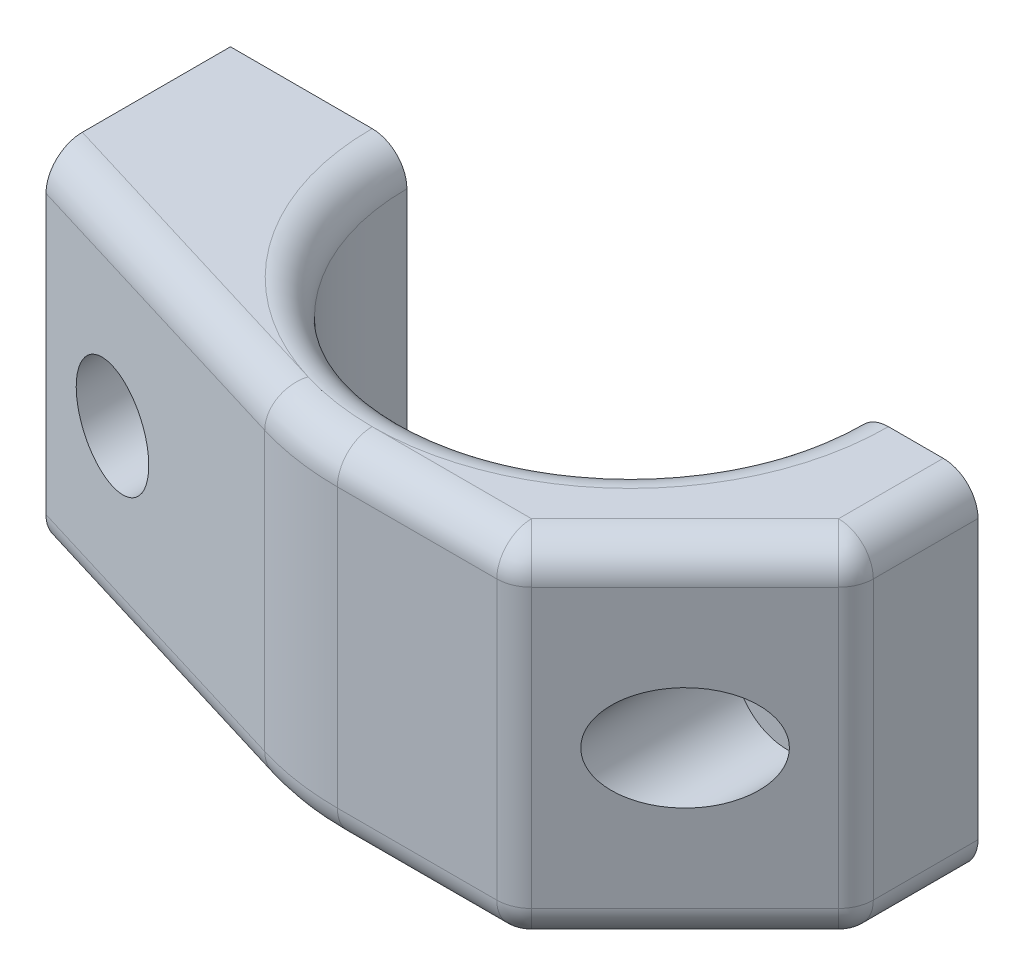
ISO-10303-21;
HEADER;
FILE_DESCRIPTION(('STEP AP214'),'2;1');
FILE_NAME('part.step','',(''),(''),'','','');
FILE_SCHEMA(('AUTOMOTIVE_DESIGN { 1 0 10303 214 1 1 1 1 }'));
ENDSEC;
DATA;
#1=APPLICATION_CONTEXT('core data for automotive mechanical design processes');
#2=APPLICATION_PROTOCOL_DEFINITION('international standard','automotive_design',2000,#1);
#3=PRODUCT_CONTEXT('',#1,'mechanical');
#4=PRODUCT('Part','Part','',(#3));
#5=PRODUCT_RELATED_PRODUCT_CATEGORY('part','',(#4));
#6=PRODUCT_DEFINITION_FORMATION('','',#4);
#7=PRODUCT_DEFINITION_CONTEXT('part definition',#1,'design');
#8=PRODUCT_DEFINITION('design','',#6,#7);
#9=PRODUCT_DEFINITION_SHAPE('','',#8);
#10=(LENGTH_UNIT() NAMED_UNIT(*) SI_UNIT(.MILLI.,.METRE.));
#11=(NAMED_UNIT(*) PLANE_ANGLE_UNIT() SI_UNIT($,.RADIAN.));
#12=(NAMED_UNIT(*) SI_UNIT($,.STERADIAN.) SOLID_ANGLE_UNIT());
#13=UNCERTAINTY_MEASURE_WITH_UNIT(LENGTH_MEASURE(1.E-05),#10,'distance_accuracy_value','');
#14=(GEOMETRIC_REPRESENTATION_CONTEXT(3) GLOBAL_UNCERTAINTY_ASSIGNED_CONTEXT((#13)) GLOBAL_UNIT_ASSIGNED_CONTEXT((#10,
#11,#12)) REPRESENTATION_CONTEXT('',''));
#15=CARTESIAN_POINT('',(0.,0.,0.));
#16=DIRECTION('',(0.,0.,1.));
#17=DIRECTION('',(1.,0.,0.));
#18=AXIS2_PLACEMENT_3D('',#15,#16,#17);
#19=CARTESIAN_POINT('',(54.15,0.,-16.85));
#20=DIRECTION('',(0.,0.,1.));
#21=DIRECTION('',(1.,0.,0.));
#22=AXIS2_PLACEMENT_3D('',#19,#20,#21);
#23=CYLINDRICAL_SURFACE('',#22,1.65);
#24=CARTESIAN_POINT('',(54.15,0.,6.));
#25=DIRECTION('',(0.,0.,1.));
#26=DIRECTION('',(1.,0.,0.));
#27=AXIS2_PLACEMENT_3D('',#24,#25,#26);
#28=CIRCLE('',#27,1.65);
#29=CARTESIAN_POINT('',(55.8,0.,6.));
#30=VERTEX_POINT('',#29);
#31=EDGE_CURVE('E342',#30,#30,#28,.F.);
#32=ORIENTED_EDGE('',*,*,#31,.F.);
#33=EDGE_LOOP('',(#32));
#34=FACE_BOUND('',#33,.T.);
#35=CARTESIAN_POINT('',(54.15,0.,0.));
#36=DIRECTION('',(0.,0.,-1.));
#37=DIRECTION('',(-1.,0.,0.));
#38=AXIS2_PLACEMENT_3D('',#35,#36,#37);
#39=CIRCLE('',#38,1.65);
#40=CARTESIAN_POINT('',(52.5,0.,0.));
#41=VERTEX_POINT('',#40);
#42=EDGE_CURVE('E415',#41,#41,#39,.F.);
#43=ORIENTED_EDGE('',*,*,#42,.F.);
#44=EDGE_LOOP('',(#43));
#45=FACE_BOUND('',#44,.T.);
#46=ADVANCED_FACE('F60',(#34,#45),#23,.F.);
#47=CARTESIAN_POINT('',(21.65,0.,-16.85));
#48=DIRECTION('',(0.,0.,1.));
#49=DIRECTION('',(1.,0.,0.));
#50=AXIS2_PLACEMENT_3D('',#47,#48,#49);
#51=CYLINDRICAL_SURFACE('',#50,1.65);
#52=CARTESIAN_POINT('',(21.65,0.,6.));
#53=DIRECTION('',(0.,0.,1.));
#54=DIRECTION('',(1.,0.,0.));
#55=AXIS2_PLACEMENT_3D('',#52,#53,#54);
#56=CIRCLE('',#55,1.65);
#57=CARTESIAN_POINT('',(23.3,0.,6.));
#58=VERTEX_POINT('',#57);
#59=EDGE_CURVE('E339',#58,#58,#56,.F.);
#60=ORIENTED_EDGE('',*,*,#59,.F.);
#61=EDGE_LOOP('',(#60));
#62=FACE_BOUND('',#61,.T.);
#63=CARTESIAN_POINT('',(21.65,0.,0.));
#64=DIRECTION('',(0.,0.,-1.));
#65=DIRECTION('',(-1.,0.,0.));
#66=AXIS2_PLACEMENT_3D('',#63,#64,#65);
#67=CIRCLE('',#66,1.65);
#68=CARTESIAN_POINT('',(20.,0.,0.));
#69=VERTEX_POINT('',#68);
#70=EDGE_CURVE('E200',#69,#69,#67,.F.);
#71=ORIENTED_EDGE('',*,*,#70,.F.);
#72=EDGE_LOOP('',(#71));
#73=FACE_BOUND('',#72,.T.);
#74=ADVANCED_FACE('F473',(#62,#73),#51,.F.);
#75=CARTESIAN_POINT('',(39.15,10.,0.));
#76=DIRECTION('',(0.,1.,0.));
#77=DIRECTION('',(0.,0.,1.));
#78=AXIS2_PLACEMENT_3D('',#75,#76,#77);
#79=PLANE('',#78);
#80=CARTESIAN_POINT('',(39.15,10.,0.));
#81=DIRECTION('',(0.,1.,0.));
#82=DIRECTION('',(0.,0.,1.));
#83=AXIS2_PLACEMENT_3D('',#80,#81,#82);
#84=CIRCLE('',#83,14.85);
#85=CARTESIAN_POINT('',(34.8233951804406,10.,14.2057379511015));
#86=VERTEX_POINT('',#85);
#87=CARTESIAN_POINT('',(24.3,10.,0.));
#88=VERTEX_POINT('',#87);
#89=EDGE_CURVE('E251',#86,#88,#84,.F.);
#90=ORIENTED_EDGE('',*,*,#89,.T.);
#91=DIRECTION('',(-1.,0.,0.));
#92=VECTOR('',#91,1.);
#93=CARTESIAN_POINT('',(39.15,10.,0.));
#94=LINE('',#93,#92);
#95=CARTESIAN_POINT('',(16.15,10.,0.));
#96=VERTEX_POINT('',#95);
#97=EDGE_CURVE('E75',#88,#96,#94,.T.);
#98=ORIENTED_EDGE('',*,*,#97,.T.);
#99=DIRECTION('',(0.,0.,1.));
#100=VECTOR('',#99,1.);
#101=CARTESIAN_POINT('',(16.15,10.,0.));
#102=LINE('',#101,#100);
#103=CARTESIAN_POINT('',(16.15,10.,8.51843033897093));
#104=VERTEX_POINT('',#103);
#105=EDGE_CURVE('E207',#104,#96,#102,.F.);
#106=ORIENTED_EDGE('',*,*,#105,.F.);
#107=DIRECTION('',(0.956615350242525,0.,0.29135385990299));
#108=VECTOR('',#107,1.);
#109=CARTESIAN_POINT('',(34.8233951804406,10.,14.2057379511015));
#110=LINE('',#109,#108);
#111=EDGE_CURVE('E254',#104,#86,#110,.T.);
#112=ORIENTED_EDGE('',*,*,#111,.T.);
#113=EDGE_LOOP('',(#90,#98,#106,#112));
#114=FACE_BOUND('',#113,.T.);
#115=ADVANCED_FACE('F357',(#114),#79,.T.);
#116=CARTESIAN_POINT('',(39.15,-10.,0.));
#117=DIRECTION('',(0.,1.,0.));
#118=DIRECTION('',(0.,0.,1.));
#119=AXIS2_PLACEMENT_3D('',#116,#117,#118);
#120=PLANE('',#119);
#121=DIRECTION('',(-1.,0.,0.));
#122=VECTOR('',#121,1.);
#123=CARTESIAN_POINT('',(39.15,-10.,0.));
#124=LINE('',#123,#122);
#125=CARTESIAN_POINT('',(57.15,-10.,0.));
#126=VERTEX_POINT('',#125);
#127=CARTESIAN_POINT('',(54.,-10.,0.));
#128=VERTEX_POINT('',#127);
#129=EDGE_CURVE('E404',#126,#128,#124,.T.);
#130=ORIENTED_EDGE('',*,*,#129,.F.);
#131=DIRECTION('',(0.,0.,-1.));
#132=VECTOR('',#131,1.);
#133=CARTESIAN_POINT('',(57.15,-10.,0.));
#134=LINE('',#133,#132);
#135=CARTESIAN_POINT('',(57.15,-10.,6.02157287525381));
#136=VERTEX_POINT('',#135);
#137=EDGE_CURVE('E230',#126,#136,#134,.F.);
#138=ORIENTED_EDGE('',*,*,#137,.T.);
#139=DIRECTION('',(-0.707106781186548,0.,0.707106781186548));
#140=VECTOR('',#139,1.);
#141=CARTESIAN_POINT('',(51.1607864376269,-10.,12.0107864376269));
#142=LINE('',#141,#140);
#143=CARTESIAN_POINT('',(48.3215728752538,-10.,14.85));
#144=VERTEX_POINT('',#143);
#145=EDGE_CURVE('E228',#136,#144,#142,.T.);
#146=ORIENTED_EDGE('',*,*,#145,.T.);
#147=DIRECTION('',(1.,0.,0.));
#148=VECTOR('',#147,1.);
#149=CARTESIAN_POINT('',(39.15,-10.,14.85));
#150=LINE('',#149,#148);
#151=CARTESIAN_POINT('',(39.15,-10.,14.85));
#152=VERTEX_POINT('',#151);
#153=EDGE_CURVE('E226',#144,#152,#150,.F.);
#154=ORIENTED_EDGE('',*,*,#153,.T.);
#155=CARTESIAN_POINT('',(39.15,-10.,0.));
#156=DIRECTION('',(0.,1.,0.));
#157=DIRECTION('',(0.,0.,1.));
#158=AXIS2_PLACEMENT_3D('',#155,#156,#157);
#159=CIRCLE('',#158,14.85);
#160=EDGE_CURVE('E223',#152,#128,#159,.T.);
#161=ORIENTED_EDGE('',*,*,#160,.T.);
#162=EDGE_LOOP('',(#130,#138,#146,#154,#161));
#163=FACE_BOUND('',#162,.T.);
#164=ADVANCED_FACE('F504',(#163),#120,.F.);
#165=DIRECTION('',(0.,0.,-1.));
#166=VECTOR('',#165,1.);
#167=CARTESIAN_POINT('',(57.15,10.,-6.84999999999999));
#168=LINE('',#167,#166);
#169=CARTESIAN_POINT('',(57.15,10.,6.02157287525381));
#170=VERTEX_POINT('',#169);
#171=CARTESIAN_POINT('',(57.15,10.,0.));
#172=VERTEX_POINT('',#171);
#173=EDGE_CURVE('E248',#170,#172,#168,.T.);
#174=ORIENTED_EDGE('',*,*,#173,.T.);
#175=DIRECTION('',(-1.,0.,0.));
#176=VECTOR('',#175,1.);
#177=CARTESIAN_POINT('',(39.15,10.,0.));
#178=LINE('',#177,#176);
#179=CARTESIAN_POINT('',(54.,10.,0.));
#180=VERTEX_POINT('',#179);
#181=EDGE_CURVE('E374',#172,#180,#178,.T.);
#182=ORIENTED_EDGE('',*,*,#181,.T.);
#183=CARTESIAN_POINT('',(39.15,10.,0.));
#184=DIRECTION('',(0.,1.,0.));
#185=DIRECTION('',(0.,0.,1.));
#186=AXIS2_PLACEMENT_3D('',#183,#184,#185);
#187=CIRCLE('',#186,14.85);
#188=CARTESIAN_POINT('',(39.15,10.,14.85));
#189=VERTEX_POINT('',#188);
#190=EDGE_CURVE('E242',#180,#189,#187,.F.);
#191=ORIENTED_EDGE('',*,*,#190,.T.);
#192=DIRECTION('',(1.,0.,0.));
#193=VECTOR('',#192,1.);
#194=CARTESIAN_POINT('',(49.15,10.,14.85));
#195=LINE('',#194,#193);
#196=CARTESIAN_POINT('',(48.3215728752538,10.,14.85));
#197=VERTEX_POINT('',#196);
#198=EDGE_CURVE('E244',#189,#197,#195,.T.);
#199=ORIENTED_EDGE('',*,*,#198,.T.);
#200=DIRECTION('',(-0.707106781186548,0.,0.707106781186548));
#201=VECTOR('',#200,1.);
#202=CARTESIAN_POINT('',(57.7357864376269,10.,5.4357864376269));
#203=LINE('',#202,#201);
#204=EDGE_CURVE('E246',#197,#170,#203,.F.);
#205=ORIENTED_EDGE('',*,*,#204,.T.);
#206=EDGE_LOOP('',(#174,#182,#191,#199,#205));
#207=FACE_BOUND('',#206,.T.);
#208=ADVANCED_FACE('F372',(#207),#79,.T.);
#209=DIRECTION('',(-1.,0.,0.));
#210=VECTOR('',#209,1.);
#211=CARTESIAN_POINT('',(39.15,-10.,0.));
#212=LINE('',#211,#210);
#213=CARTESIAN_POINT('',(24.3,-10.,0.));
#214=VERTEX_POINT('',#213);
#215=CARTESIAN_POINT('',(16.15,-10.,0.));
#216=VERTEX_POINT('',#215);
#217=EDGE_CURVE('E190',#214,#216,#212,.T.);
#218=ORIENTED_EDGE('',*,*,#217,.F.);
#219=CARTESIAN_POINT('',(39.15,-10.,0.));
#220=DIRECTION('',(0.,1.,0.));
#221=DIRECTION('',(0.,0.,1.));
#222=AXIS2_PLACEMENT_3D('',#219,#220,#221);
#223=CIRCLE('',#222,14.85);
#224=CARTESIAN_POINT('',(34.8233951804406,-10.,14.2057379511015));
#225=VERTEX_POINT('',#224);
#226=EDGE_CURVE('E213',#214,#225,#223,.T.);
#227=ORIENTED_EDGE('',*,*,#226,.T.);
#228=DIRECTION('',(0.956615350242525,0.,0.29135385990299));
#229=VECTOR('',#228,1.);
#230=CARTESIAN_POINT('',(34.8233951804406,-10.,14.2057379511015));
#231=LINE('',#230,#229);
#232=CARTESIAN_POINT('',(16.15,-10.,8.51843033897093));
#233=VERTEX_POINT('',#232);
#234=EDGE_CURVE('E212',#225,#233,#231,.F.);
#235=ORIENTED_EDGE('',*,*,#234,.T.);
#236=DIRECTION('',(0.,0.,1.));
#237=VECTOR('',#236,1.);
#238=CARTESIAN_POINT('',(16.15,-10.,-10.));
#239=LINE('',#238,#237);
#240=EDGE_CURVE('E204',#233,#216,#239,.F.);
#241=ORIENTED_EDGE('',*,*,#240,.T.);
#242=EDGE_LOOP('',(#218,#227,#235,#241));
#243=FACE_BOUND('',#242,.T.);
#244=ADVANCED_FACE('F210',(#243),#120,.F.);
#245=CARTESIAN_POINT('',(14.15,10.,10.));
#246=DIRECTION('',(0.29135385990299,0.,-0.956615350242525));
#247=DIRECTION('',(-0.956615350242525,0.,-0.29135385990299));
#248=AXIS2_PLACEMENT_3D('',#245,#246,#247);
#249=PLANE('',#248);
#250=CARTESIAN_POINT('',(21.65,0.,12.284255577457));
#251=DIRECTION('',(0.29135385990299,0.,-0.956615350242525));
#252=DIRECTION('',(-0.956615350242525,0.,-0.29135385990299));
#253=AXIS2_PLACEMENT_3D('',#250,#251,#252);
#254=ELLIPSE('',#253,3.13605672252638,3.);
#255=CARTESIAN_POINT('',(18.65,0.,11.3705533464742));
#256=VERTEX_POINT('',#255);
#257=EDGE_CURVE('E289',#256,#256,#254,.F.);
#258=ORIENTED_EDGE('',*,*,#257,.F.);
#259=EDGE_LOOP('',(#258));
#260=FACE_BOUND('',#259,.T.);
#261=DIRECTION('',(0.,1.,0.));
#262=VECTOR('',#261,1.);
#263=CARTESIAN_POINT('',(16.15,10.,10.6091348206552));
#264=LINE('',#263,#262);
#265=CARTESIAN_POINT('',(16.15,-7.99999999999999,10.6091348206552));
#266=VERTEX_POINT('',#265);
#267=CARTESIAN_POINT('',(16.15,8.,10.6091348206552));
#268=VERTEX_POINT('',#267);
#269=EDGE_CURVE('E419',#266,#268,#264,.T.);
#270=ORIENTED_EDGE('',*,*,#269,.F.);
#271=DIRECTION('',(0.956615350242525,0.,0.29135385990299));
#272=VECTOR('',#271,1.);
#273=CARTESIAN_POINT('',(14.15,-8.,10.));
#274=LINE('',#273,#272);
#275=CARTESIAN_POINT('',(34.2406874606346,-8.,16.1189686515866));
#276=VERTEX_POINT('',#275);
#277=EDGE_CURVE('E240',#266,#276,#274,.T.);
#278=ORIENTED_EDGE('',*,*,#277,.T.);
#279=DIRECTION('',(0.,-1.,0.));
#280=VECTOR('',#279,1.);
#281=CARTESIAN_POINT('',(34.2406874606346,10.,16.1189686515866));
#282=LINE('',#281,#280);
#283=CARTESIAN_POINT('',(34.2406874606346,8.,16.1189686515866));
#284=VERTEX_POINT('',#283);
#285=EDGE_CURVE('E214',#284,#276,#282,.T.);
#286=ORIENTED_EDGE('',*,*,#285,.F.);
#287=DIRECTION('',(0.956615350242525,0.,0.29135385990299));
#288=VECTOR('',#287,1.);
#289=CARTESIAN_POINT('',(16.15,8.,10.6091348206552));
#290=LINE('',#289,#288);
#291=EDGE_CURVE('E237',#284,#268,#290,.F.);
#292=ORIENTED_EDGE('',*,*,#291,.T.);
#293=EDGE_LOOP('',(#270,#278,#286,#292));
#294=FACE_BOUND('',#293,.T.);
#295=ADVANCED_FACE('F500',(#260,#294),#249,.F.);
#296=CARTESIAN_POINT('',(39.15,10.,0.));
#297=DIRECTION('',(0.,-1.,0.));
#298=DIRECTION('',(0.,0.,-1.));
#299=AXIS2_PLACEMENT_3D('',#296,#297,#298);
#300=CYLINDRICAL_SURFACE('',#299,12.85);
#301=CARTESIAN_POINT('',(39.15,8.,0.));
#302=DIRECTION('',(0.,1.,0.));
#303=DIRECTION('',(0.,0.,1.));
#304=AXIS2_PLACEMENT_3D('',#301,#302,#303);
#305=CIRCLE('',#304,12.85);
#306=CARTESIAN_POINT('',(26.3,8.,0.));
#307=VERTEX_POINT('',#306);
#308=CARTESIAN_POINT('',(52.,8.,0.));
#309=VERTEX_POINT('',#308);
#310=EDGE_CURVE('E278',#307,#309,#305,.T.);
#311=ORIENTED_EDGE('',*,*,#310,.T.);
#312=DIRECTION('',(0.,-1.,0.));
#313=VECTOR('',#312,1.);
#314=CARTESIAN_POINT('',(52.,10.,0.));
#315=LINE('',#314,#313);
#316=CARTESIAN_POINT('',(52.,-8.,0.));
#317=VERTEX_POINT('',#316);
#318=EDGE_CURVE('E83',#309,#317,#315,.T.);
#319=ORIENTED_EDGE('',*,*,#318,.T.);
#320=CARTESIAN_POINT('',(39.15,-8.,0.));
#321=DIRECTION('',(0.,1.,0.));
#322=DIRECTION('',(0.,0.,1.));
#323=AXIS2_PLACEMENT_3D('',#320,#321,#322);
#324=CIRCLE('',#323,12.85);
#325=CARTESIAN_POINT('',(26.3,-8.,0.));
#326=VERTEX_POINT('',#325);
#327=EDGE_CURVE('E281',#317,#326,#324,.F.);
#328=ORIENTED_EDGE('',*,*,#327,.T.);
#329=DIRECTION('',(0.,-1.,0.));
#330=VECTOR('',#329,1.);
#331=CARTESIAN_POINT('',(26.3,10.,0.));
#332=LINE('',#331,#330);
#333=EDGE_CURVE('E409',#326,#307,#332,.F.);
#334=ORIENTED_EDGE('',*,*,#333,.T.);
#335=EDGE_LOOP('',(#311,#319,#328,#334));
#336=FACE_BOUND('',#335,.T.);
#337=ADVANCED_FACE('F494',(#336),#300,.F.);
#338=CARTESIAN_POINT('',(59.15,10.,-16.85));
#339=DIRECTION('',(-1.,0.,0.));
#340=DIRECTION('',(0.,0.,1.));
#341=AXIS2_PLACEMENT_3D('',#338,#339,#340);
#342=PLANE('',#341);
#343=DIRECTION('',(0.,-1.,0.));
#344=VECTOR('',#343,1.);
#345=CARTESIAN_POINT('',(59.15,10.,0.));
#346=LINE('',#345,#344);
#347=CARTESIAN_POINT('',(59.15,8.,0.));
#348=VERTEX_POINT('',#347);
#349=CARTESIAN_POINT('',(59.15,-8.,0.));
#350=VERTEX_POINT('',#349);
#351=EDGE_CURVE('E398',#348,#350,#346,.T.);
#352=ORIENTED_EDGE('',*,*,#351,.F.);
#353=DIRECTION('',(0.,0.,-1.));
#354=VECTOR('',#353,1.);
#355=CARTESIAN_POINT('',(59.15,8.,6.85));
#356=LINE('',#355,#354);
#357=CARTESIAN_POINT('',(59.15,8.,6.02157287525381));
#358=VERTEX_POINT('',#357);
#359=EDGE_CURVE('E271',#348,#358,#356,.F.);
#360=ORIENTED_EDGE('',*,*,#359,.T.);
#361=DIRECTION('',(0.,-1.,0.));
#362=VECTOR('',#361,1.);
#363=CARTESIAN_POINT('',(59.15,10.,6.02157287525381));
#364=LINE('',#363,#362);
#365=CARTESIAN_POINT('',(59.15,-8.,6.02157287525381));
#366=VERTEX_POINT('',#365);
#367=EDGE_CURVE('E273',#358,#366,#364,.T.);
#368=ORIENTED_EDGE('',*,*,#367,.T.);
#369=DIRECTION('',(0.,0.,-1.));
#370=VECTOR('',#369,1.);
#371=CARTESIAN_POINT('',(59.15,-8.,-16.85));
#372=LINE('',#371,#370);
#373=EDGE_CURVE('E275',#366,#350,#372,.T.);
#374=ORIENTED_EDGE('',*,*,#373,.T.);
#375=EDGE_LOOP('',(#352,#360,#368,#374));
#376=FACE_BOUND('',#375,.T.);
#377=ADVANCED_FACE('F491',(#376),#342,.F.);
#378=CARTESIAN_POINT('',(14.732707719806,-8.,8.08676929951495));
#379=DIRECTION('',(0.956615350242525,0.,0.29135385990299));
#380=DIRECTION('',(0.29135385990299,0.,-0.956615350242525));
#381=AXIS2_PLACEMENT_3D('',#378,#379,#380);
#382=CYLINDRICAL_SURFACE('',#381,2.);
#383=ORIENTED_EDGE('',*,*,#277,.F.);
#384=CARTESIAN_POINT('',(16.15,-8.,8.51843033897093));
#385=DIRECTION('',(-1.,0.,0.));
#386=DIRECTION('',(0.,0.,1.));
#387=AXIS2_PLACEMENT_3D('',#384,#385,#386);
#388=ELLIPSE('',#387,2.09070448168426,2.);
#389=EDGE_CURVE('E421',#266,#233,#388,.F.);
#390=ORIENTED_EDGE('',*,*,#389,.T.);
#391=ORIENTED_EDGE('',*,*,#234,.F.);
#392=CARTESIAN_POINT('',(34.8233951804406,-8.,14.2057379511015));
#393=DIRECTION('',(0.956615350242525,0.,0.29135385990299));
#394=DIRECTION('',(0.29135385990299,0.,-0.956615350242525));
#395=AXIS2_PLACEMENT_3D('',#392,#393,#394);
#396=CIRCLE('',#395,2.);
#397=EDGE_CURVE('E336',#276,#225,#396,.T.);
#398=ORIENTED_EDGE('',*,*,#397,.F.);
#399=EDGE_LOOP('',(#383,#390,#391,#398));
#400=FACE_BOUND('',#399,.T.);
#401=ADVANCED_FACE('F62',(#400),#382,.T.);
#402=CARTESIAN_POINT('',(39.15,-8.,0.));
#403=DIRECTION('',(0.,1.,0.));
#404=DIRECTION('',(0.,0.,1.));
#405=AXIS2_PLACEMENT_3D('',#402,#403,#404);
#406=TOROIDAL_SURFACE('',#405,14.85,2.);
#407=ORIENTED_EDGE('',*,*,#226,.F.);
#408=CARTESIAN_POINT('',(24.3,-8.,0.));
#409=DIRECTION('',(0.,0.,-1.));
#410=DIRECTION('',(-1.,0.,0.));
#411=AXIS2_PLACEMENT_3D('',#408,#409,#410);
#412=CIRCLE('',#411,2.);
#413=EDGE_CURVE('E196',#214,#326,#412,.F.);
#414=ORIENTED_EDGE('',*,*,#413,.T.);
#415=ORIENTED_EDGE('',*,*,#327,.F.);
#416=CARTESIAN_POINT('',(54.,-8.,0.));
#417=DIRECTION('',(0.,0.,-1.));
#418=DIRECTION('',(-1.,0.,0.));
#419=AXIS2_PLACEMENT_3D('',#416,#417,#418);
#420=CIRCLE('',#419,2.);
#421=EDGE_CURVE('E395',#317,#128,#420,.F.);
#422=ORIENTED_EDGE('',*,*,#421,.T.);
#423=ORIENTED_EDGE('',*,*,#160,.F.);
#424=CARTESIAN_POINT('',(39.15,-10.,0.));
#425=DIRECTION('',(0.,1.,0.));
#426=DIRECTION('',(0.,0.,1.));
#427=AXIS2_PLACEMENT_3D('',#424,#425,#426);
#428=CIRCLE('',#427,14.85);
#429=EDGE_CURVE('E333',#152,#225,#428,.F.);
#430=ORIENTED_EDGE('',*,*,#429,.T.);
#431=EDGE_LOOP('',(#407,#414,#415,#422,#423,#430));
#432=FACE_BOUND('',#431,.T.);
#433=ADVANCED_FACE('F532',(#432),#406,.T.);
#434=CARTESIAN_POINT('',(57.15,-8.,-16.85));
#435=DIRECTION('',(0.,0.,-1.));
#436=DIRECTION('',(-1.,0.,0.));
#437=AXIS2_PLACEMENT_3D('',#434,#435,#436);
#438=CYLINDRICAL_SURFACE('',#437,2.);
#439=ORIENTED_EDGE('',*,*,#137,.F.);
#440=CARTESIAN_POINT('',(57.15,-8.,0.));
#441=DIRECTION('',(0.,0.,-1.));
#442=DIRECTION('',(-1.,0.,0.));
#443=AXIS2_PLACEMENT_3D('',#440,#441,#442);
#444=CIRCLE('',#443,2.);
#445=EDGE_CURVE('E406',#126,#350,#444,.F.);
#446=ORIENTED_EDGE('',*,*,#445,.T.);
#447=ORIENTED_EDGE('',*,*,#373,.F.);
#448=CARTESIAN_POINT('',(57.15,-8.,6.02157287525381));
#449=DIRECTION('',(0.,0.,1.));
#450=DIRECTION('',(1.,0.,0.));
#451=AXIS2_PLACEMENT_3D('',#448,#449,#450);
#452=CIRCLE('',#451,2.);
#453=EDGE_CURVE('E330',#366,#136,#452,.F.);
#454=ORIENTED_EDGE('',*,*,#453,.T.);
#455=EDGE_LOOP('',(#439,#446,#447,#454));
#456=FACE_BOUND('',#455,.T.);
#457=ADVANCED_FACE('F528',(#456),#438,.T.);
#458=CARTESIAN_POINT('',(57.15,8.,0.));
#459=DIRECTION('',(0.,0.,1.));
#460=DIRECTION('',(1.,0.,0.));
#461=AXIS2_PLACEMENT_3D('',#458,#459,#460);
#462=CYLINDRICAL_SURFACE('',#461,2.);
#463=ORIENTED_EDGE('',*,*,#359,.F.);
#464=CARTESIAN_POINT('',(57.15,8.,0.));
#465=DIRECTION('',(0.,0.,-1.));
#466=DIRECTION('',(-1.,0.,0.));
#467=AXIS2_PLACEMENT_3D('',#464,#465,#466);
#468=CIRCLE('',#467,2.);
#469=EDGE_CURVE('E393',#348,#172,#468,.F.);
#470=ORIENTED_EDGE('',*,*,#469,.T.);
#471=ORIENTED_EDGE('',*,*,#173,.F.);
#472=CARTESIAN_POINT('',(57.15,8.,6.02157287525381));
#473=DIRECTION('',(0.,0.,1.));
#474=DIRECTION('',(0.,-1.,0.));
#475=AXIS2_PLACEMENT_3D('',#472,#473,#474);
#476=CIRCLE('',#475,2.);
#477=EDGE_CURVE('E309',#170,#358,#476,.F.);
#478=ORIENTED_EDGE('',*,*,#477,.T.);
#479=EDGE_LOOP('',(#463,#470,#471,#478));
#480=FACE_BOUND('',#479,.T.);
#481=ADVANCED_FACE('F392',(#480),#462,.T.);
#482=CARTESIAN_POINT('',(34.8233951804406,8.,14.2057379511015));
#483=DIRECTION('',(-0.956615350242525,0.,-0.29135385990299));
#484=DIRECTION('',(-0.29135385990299,0.,0.956615350242525));
#485=AXIS2_PLACEMENT_3D('',#482,#483,#484);
#486=CYLINDRICAL_SURFACE('',#485,2.);
#487=ORIENTED_EDGE('',*,*,#111,.F.);
#488=CARTESIAN_POINT('',(16.15,8.,8.51843033897093));
#489=DIRECTION('',(-1.,0.,0.));
#490=DIRECTION('',(0.,0.,-1.));
#491=AXIS2_PLACEMENT_3D('',#488,#489,#490);
#492=ELLIPSE('',#491,2.09070448168426,2.);
#493=EDGE_CURVE('E13',#104,#268,#492,.F.);
#494=ORIENTED_EDGE('',*,*,#493,.T.);
#495=ORIENTED_EDGE('',*,*,#291,.F.);
#496=CARTESIAN_POINT('',(34.8233951804406,8.,14.2057379511015));
#497=DIRECTION('',(0.956615350242525,0.,0.29135385990299));
#498=DIRECTION('',(0.29135385990299,0.,-0.956615350242525));
#499=AXIS2_PLACEMENT_3D('',#496,#497,#498);
#500=CIRCLE('',#499,2.);
#501=EDGE_CURVE('E288',#86,#284,#500,.T.);
#502=ORIENTED_EDGE('',*,*,#501,.F.);
#503=EDGE_LOOP('',(#487,#494,#495,#502));
#504=FACE_BOUND('',#503,.T.);
#505=ADVANCED_FACE('F363',(#504),#486,.T.);
#506=CARTESIAN_POINT('',(39.15,8.,0.));
#507=DIRECTION('',(0.,1.,0.));
#508=DIRECTION('',(0.,0.,1.));
#509=AXIS2_PLACEMENT_3D('',#506,#507,#508);
#510=TOROIDAL_SURFACE('',#509,14.85,2.);
#511=ORIENTED_EDGE('',*,*,#310,.F.);
#512=CARTESIAN_POINT('',(24.3,8.,0.));
#513=DIRECTION('',(0.,0.,-1.));
#514=DIRECTION('',(-1.,0.,0.));
#515=AXIS2_PLACEMENT_3D('',#512,#513,#514);
#516=CIRCLE('',#515,2.);
#517=EDGE_CURVE('E68',#307,#88,#516,.F.);
#518=ORIENTED_EDGE('',*,*,#517,.T.);
#519=ORIENTED_EDGE('',*,*,#89,.F.);
#520=CARTESIAN_POINT('',(39.15,10.,0.));
#521=DIRECTION('',(0.,1.,0.));
#522=DIRECTION('',(0.,0.,1.));
#523=AXIS2_PLACEMENT_3D('',#520,#521,#522);
#524=CIRCLE('',#523,14.85);
#525=EDGE_CURVE('E285',#86,#189,#524,.T.);
#526=ORIENTED_EDGE('',*,*,#525,.T.);
#527=ORIENTED_EDGE('',*,*,#190,.F.);
#528=CARTESIAN_POINT('',(54.,8.,0.));
#529=DIRECTION('',(0.,0.,-1.));
#530=DIRECTION('',(-1.,0.,0.));
#531=AXIS2_PLACEMENT_3D('',#528,#529,#530);
#532=CIRCLE('',#531,2.);
#533=EDGE_CURVE('E284',#180,#309,#532,.F.);
#534=ORIENTED_EDGE('',*,*,#533,.T.);
#535=EDGE_LOOP('',(#511,#518,#519,#526,#527,#534));
#536=FACE_BOUND('',#535,.T.);
#537=ADVANCED_FACE('F354',(#536),#510,.T.);
#538=CARTESIAN_POINT('',(39.15,10.,0.));
#539=DIRECTION('',(0.,-1.,0.));
#540=DIRECTION('',(0.,0.,-1.));
#541=AXIS2_PLACEMENT_3D('',#538,#539,#540);
#542=CYLINDRICAL_SURFACE('',#541,16.85);
#543=ORIENTED_EDGE('',*,*,#285,.T.);
#544=CARTESIAN_POINT('',(39.15,-8.,0.));
#545=DIRECTION('',(0.,1.,0.));
#546=DIRECTION('',(0.,0.,1.));
#547=AXIS2_PLACEMENT_3D('',#544,#545,#546);
#548=CIRCLE('',#547,16.85);
#549=CARTESIAN_POINT('',(39.15,-8.,16.85));
#550=VERTEX_POINT('',#549);
#551=EDGE_CURVE('E234',#276,#550,#548,.T.);
#552=ORIENTED_EDGE('',*,*,#551,.T.);
#553=DIRECTION('',(0.,-1.,0.));
#554=VECTOR('',#553,1.);
#555=CARTESIAN_POINT('',(39.15,10.,16.85));
#556=LINE('',#555,#554);
#557=CARTESIAN_POINT('',(39.15,8.,16.85));
#558=VERTEX_POINT('',#557);
#559=EDGE_CURVE('E218',#558,#550,#556,.T.);
#560=ORIENTED_EDGE('',*,*,#559,.F.);
#561=CARTESIAN_POINT('',(39.15,8.,0.));
#562=DIRECTION('',(0.,1.,0.));
#563=DIRECTION('',(0.,0.,1.));
#564=AXIS2_PLACEMENT_3D('',#561,#562,#563);
#565=CIRCLE('',#564,16.85);
#566=EDGE_CURVE('E232',#558,#284,#565,.F.);
#567=ORIENTED_EDGE('',*,*,#566,.T.);
#568=EDGE_LOOP('',(#543,#552,#560,#567));
#569=FACE_BOUND('',#568,.T.);
#570=ADVANCED_FACE('F433',(#569),#542,.T.);
#571=CARTESIAN_POINT('',(59.15,10.,16.85));
#572=DIRECTION('',(0.,0.,-1.));
#573=DIRECTION('',(-1.,0.,0.));
#574=AXIS2_PLACEMENT_3D('',#571,#572,#573);
#575=PLANE('',#574);
#576=DIRECTION('',(0.,-1.,0.));
#577=VECTOR('',#576,1.);
#578=CARTESIAN_POINT('',(48.3215728752538,10.,16.85));
#579=LINE('',#578,#577);
#580=CARTESIAN_POINT('',(48.3215728752538,-8.,16.85));
#581=VERTEX_POINT('',#580);
#582=CARTESIAN_POINT('',(48.3215728752538,8.,16.85));
#583=VERTEX_POINT('',#582);
#584=EDGE_CURVE('E258',#581,#583,#579,.F.);
#585=ORIENTED_EDGE('',*,*,#584,.T.);
#586=DIRECTION('',(1.,0.,0.));
#587=VECTOR('',#586,1.);
#588=CARTESIAN_POINT('',(39.15,8.,16.85));
#589=LINE('',#588,#587);
#590=EDGE_CURVE('E260',#583,#558,#589,.F.);
#591=ORIENTED_EDGE('',*,*,#590,.T.);
#592=ORIENTED_EDGE('',*,*,#559,.T.);
#593=DIRECTION('',(1.,0.,0.));
#594=VECTOR('',#593,1.);
#595=CARTESIAN_POINT('',(59.15,-8.,16.85));
#596=LINE('',#595,#594);
#597=EDGE_CURVE('E256',#550,#581,#596,.T.);
#598=ORIENTED_EDGE('',*,*,#597,.T.);
#599=EDGE_LOOP('',(#585,#591,#592,#598));
#600=FACE_BOUND('',#599,.T.);
#601=ADVANCED_FACE('F430',(#600),#575,.F.);
#602=CARTESIAN_POINT('',(59.15,14.15,6.85));
#603=DIRECTION('',(-0.707106781186548,0.,-0.707106781186548));
#604=DIRECTION('',(-0.707106781186548,0.,0.707106781186548));
#605=AXIS2_PLACEMENT_3D('',#602,#603,#604);
#606=PLANE('',#605);
#607=CARTESIAN_POINT('',(54.15,0.,11.85));
#608=DIRECTION('',(-0.707106781186548,0.,-0.707106781186548));
#609=DIRECTION('',(0.707106781186548,0.,-0.707106781186548));
#610=AXIS2_PLACEMENT_3D('',#607,#608,#609);
#611=ELLIPSE('',#610,4.24264068711929,3.);
#612=CARTESIAN_POINT('',(57.15,0.,8.84999999999999));
#613=VERTEX_POINT('',#612);
#614=EDGE_CURVE('E346',#613,#613,#611,.F.);
#615=ORIENTED_EDGE('',*,*,#614,.F.);
#616=EDGE_LOOP('',(#615));
#617=FACE_BOUND('',#616,.T.);
#618=DIRECTION('',(0.,-1.,0.));
#619=VECTOR('',#618,1.);
#620=CARTESIAN_POINT('',(49.7357864376269,14.15,16.2642135623731));
#621=LINE('',#620,#619);
#622=CARTESIAN_POINT('',(49.7357864376269,8.,16.2642135623731));
#623=VERTEX_POINT('',#622);
#624=CARTESIAN_POINT('',(49.7357864376269,-8.,16.2642135623731));
#625=VERTEX_POINT('',#624);
#626=EDGE_CURVE('E266',#623,#625,#621,.T.);
#627=ORIENTED_EDGE('',*,*,#626,.T.);
#628=DIRECTION('',(-0.707106781186548,0.,0.707106781186548));
#629=VECTOR('',#628,1.);
#630=CARTESIAN_POINT('',(59.15,-8.,6.85));
#631=LINE('',#630,#629);
#632=CARTESIAN_POINT('',(58.5642135623731,-8.,7.4357864376269));
#633=VERTEX_POINT('',#632);
#634=EDGE_CURVE('E269',#625,#633,#631,.F.);
#635=ORIENTED_EDGE('',*,*,#634,.T.);
#636=DIRECTION('',(0.,-1.,0.));
#637=VECTOR('',#636,1.);
#638=CARTESIAN_POINT('',(58.5642135623731,14.15,7.4357864376269));
#639=LINE('',#638,#637);
#640=CARTESIAN_POINT('',(58.5642135623731,8.,7.4357864376269));
#641=VERTEX_POINT('',#640);
#642=EDGE_CURVE('E264',#633,#641,#639,.F.);
#643=ORIENTED_EDGE('',*,*,#642,.T.);
#644=DIRECTION('',(-0.707106781186548,0.,0.707106781186548));
#645=VECTOR('',#644,1.);
#646=CARTESIAN_POINT('',(49.15,8.,16.85));
#647=LINE('',#646,#645);
#648=EDGE_CURVE('E262',#641,#623,#647,.T.);
#649=ORIENTED_EDGE('',*,*,#648,.T.);
#650=EDGE_LOOP('',(#627,#635,#643,#649));
#651=FACE_BOUND('',#650,.T.);
#652=ADVANCED_FACE('F455',(#617,#651),#606,.F.);
#653=CARTESIAN_POINT('',(57.15,-8.,6.02157287525381));
#654=DIRECTION('',(0.,-1.,0.));
#655=DIRECTION('',(0.,0.,-1.));
#656=AXIS2_PLACEMENT_3D('',#653,#654,#655);
#657=SPHERICAL_SURFACE('',#656,2.);
#658=CARTESIAN_POINT('',(57.15,-8.,6.02157287525381));
#659=DIRECTION('',(0.707106781186547,0.,-0.707106781186548));
#660=DIRECTION('',(-0.707106781186548,0.,-0.707106781186547));
#661=AXIS2_PLACEMENT_3D('',#658,#659,#660);
#662=CIRCLE('',#661,2.);
#663=EDGE_CURVE('E324',#136,#633,#662,.F.);
#664=ORIENTED_EDGE('',*,*,#663,.F.);
#665=ORIENTED_EDGE('',*,*,#453,.F.);
#666=CARTESIAN_POINT('',(57.15,-8.,6.02157287525381));
#667=DIRECTION('',(0.,-1.,0.));
#668=DIRECTION('',(0.,0.,-1.));
#669=AXIS2_PLACEMENT_3D('',#666,#667,#668);
#670=CIRCLE('',#669,2.);
#671=EDGE_CURVE('E327',#633,#366,#670,.F.);
#672=ORIENTED_EDGE('',*,*,#671,.F.);
#673=EDGE_LOOP('',(#664,#665,#672));
#674=FACE_BOUND('',#673,.T.);
#675=ADVANCED_FACE('F489',(#674),#657,.T.);
#676=CARTESIAN_POINT('',(39.15,-8.,0.));
#677=DIRECTION('',(0.,1.,0.));
#678=DIRECTION('',(0.,0.,1.));
#679=AXIS2_PLACEMENT_3D('',#676,#677,#678);
#680=TOROIDAL_SURFACE('',#679,14.85,2.);
#681=ORIENTED_EDGE('',*,*,#551,.F.);
#682=ORIENTED_EDGE('',*,*,#397,.T.);
#683=ORIENTED_EDGE('',*,*,#429,.F.);
#684=CARTESIAN_POINT('',(39.15,-8.,14.85));
#685=DIRECTION('',(1.,0.,0.));
#686=DIRECTION('',(0.,0.,-1.));
#687=AXIS2_PLACEMENT_3D('',#684,#685,#686);
#688=CIRCLE('',#687,2.);
#689=EDGE_CURVE('E321',#550,#152,#688,.T.);
#690=ORIENTED_EDGE('',*,*,#689,.F.);
#691=EDGE_LOOP('',(#681,#682,#683,#690));
#692=FACE_BOUND('',#691,.T.);
#693=ADVANCED_FACE('F439',(#692),#680,.T.);
#694=CARTESIAN_POINT('',(57.15,10.,6.02157287525381));
#695=DIRECTION('',(0.,-1.,0.));
#696=DIRECTION('',(0.,0.,-1.));
#697=AXIS2_PLACEMENT_3D('',#694,#695,#696);
#698=CYLINDRICAL_SURFACE('',#697,2.);
#699=ORIENTED_EDGE('',*,*,#671,.T.);
#700=ORIENTED_EDGE('',*,*,#367,.F.);
#701=CARTESIAN_POINT('',(57.15,8.,6.02157287525381));
#702=DIRECTION('',(0.,1.,0.));
#703=DIRECTION('',(0.,0.,1.));
#704=AXIS2_PLACEMENT_3D('',#701,#702,#703);
#705=CIRCLE('',#704,2.);
#706=EDGE_CURVE('E318',#641,#358,#705,.T.);
#707=ORIENTED_EDGE('',*,*,#706,.F.);
#708=ORIENTED_EDGE('',*,*,#642,.F.);
#709=EDGE_LOOP('',(#699,#700,#707,#708));
#710=FACE_BOUND('',#709,.T.);
#711=ADVANCED_FACE('F460',(#710),#698,.T.);
#712=CARTESIAN_POINT('',(51.1607864376269,-8.,12.0107864376269));
#713=DIRECTION('',(-0.707106781186548,0.,0.707106781186548));
#714=DIRECTION('',(0.707106781186548,0.,0.707106781186548));
#715=AXIS2_PLACEMENT_3D('',#712,#713,#714);
#716=CYLINDRICAL_SURFACE('',#715,2.);
#717=ORIENTED_EDGE('',*,*,#663,.T.);
#718=ORIENTED_EDGE('',*,*,#634,.F.);
#719=CARTESIAN_POINT('',(48.3215728752538,-8.,14.85));
#720=DIRECTION('',(-0.707106781186548,0.,0.707106781186548));
#721=DIRECTION('',(0.707106781186548,0.,0.707106781186548));
#722=AXIS2_PLACEMENT_3D('',#719,#720,#721);
#723=CIRCLE('',#722,2.);
#724=EDGE_CURVE('E315',#144,#625,#723,.T.);
#725=ORIENTED_EDGE('',*,*,#724,.F.);
#726=ORIENTED_EDGE('',*,*,#145,.F.);
#727=EDGE_LOOP('',(#717,#718,#725,#726));
#728=FACE_BOUND('',#727,.T.);
#729=ADVANCED_FACE('F470',(#728),#716,.T.);
#730=CARTESIAN_POINT('',(59.15,-8.,14.85));
#731=DIRECTION('',(1.,0.,0.));
#732=DIRECTION('',(0.,0.,-1.));
#733=AXIS2_PLACEMENT_3D('',#730,#731,#732);
#734=CYLINDRICAL_SURFACE('',#733,2.);
#735=ORIENTED_EDGE('',*,*,#689,.T.);
#736=ORIENTED_EDGE('',*,*,#153,.F.);
#737=CARTESIAN_POINT('',(48.3215728752538,-8.,14.85));
#738=DIRECTION('',(1.,0.,0.));
#739=DIRECTION('',(0.,0.,-1.));
#740=AXIS2_PLACEMENT_3D('',#737,#738,#739);
#741=CIRCLE('',#740,2.);
#742=EDGE_CURVE('E312',#581,#144,#741,.T.);
#743=ORIENTED_EDGE('',*,*,#742,.F.);
#744=ORIENTED_EDGE('',*,*,#597,.F.);
#745=EDGE_LOOP('',(#735,#736,#743,#744));
#746=FACE_BOUND('',#745,.T.);
#747=ADVANCED_FACE('F444',(#746),#734,.T.);
#748=CARTESIAN_POINT('',(57.15,8.,6.02157287525381));
#749=DIRECTION('',(0.,1.,0.));
#750=DIRECTION('',(-1.,0.,0.));
#751=AXIS2_PLACEMENT_3D('',#748,#749,#750);
#752=SPHERICAL_SURFACE('',#751,2.);
#753=CARTESIAN_POINT('',(57.15,8.,6.02157287525381));
#754=DIRECTION('',(0.707106781186544,0.,-0.707106781186551));
#755=DIRECTION('',(-0.707106781186551,0.,-0.707106781186544));
#756=AXIS2_PLACEMENT_3D('',#753,#754,#755);
#757=CIRCLE('',#756,2.);
#758=EDGE_CURVE('E306',#641,#170,#757,.F.);
#759=ORIENTED_EDGE('',*,*,#758,.F.);
#760=ORIENTED_EDGE('',*,*,#706,.T.);
#761=ORIENTED_EDGE('',*,*,#477,.F.);
#762=EDGE_LOOP('',(#759,#760,#761));
#763=FACE_BOUND('',#762,.T.);
#764=ADVANCED_FACE('F462',(#763),#752,.T.);
#765=CARTESIAN_POINT('',(48.3215728752538,-8.,14.85));
#766=DIRECTION('',(0.,-1.,0.));
#767=DIRECTION('',(0.,0.,-1.));
#768=AXIS2_PLACEMENT_3D('',#765,#766,#767);
#769=SPHERICAL_SURFACE('',#768,2.);
#770=ORIENTED_EDGE('',*,*,#742,.T.);
#771=ORIENTED_EDGE('',*,*,#724,.T.);
#772=CARTESIAN_POINT('',(48.3215728752538,-8.,14.85));
#773=DIRECTION('',(0.,-1.,0.));
#774=DIRECTION('',(0.,0.,-1.));
#775=AXIS2_PLACEMENT_3D('',#772,#773,#774);
#776=CIRCLE('',#775,2.);
#777=EDGE_CURVE('E304',#581,#625,#776,.F.);
#778=ORIENTED_EDGE('',*,*,#777,.F.);
#779=EDGE_LOOP('',(#770,#771,#778));
#780=FACE_BOUND('',#779,.T.);
#781=ADVANCED_FACE('F449',(#780),#769,.T.);
#782=CARTESIAN_POINT('',(57.7357864376269,8.,5.4357864376269));
#783=DIRECTION('',(0.707106781186548,0.,-0.707106781186548));
#784=DIRECTION('',(-0.707106781186548,0.,-0.707106781186548));
#785=AXIS2_PLACEMENT_3D('',#782,#783,#784);
#786=CYLINDRICAL_SURFACE('',#785,2.);
#787=ORIENTED_EDGE('',*,*,#758,.T.);
#788=ORIENTED_EDGE('',*,*,#204,.F.);
#789=CARTESIAN_POINT('',(48.3215728752538,8.,14.85));
#790=DIRECTION('',(-0.707106781186547,0.,0.707106781186548));
#791=DIRECTION('',(0.707106781186548,0.,0.707106781186547));
#792=AXIS2_PLACEMENT_3D('',#789,#790,#791);
#793=CIRCLE('',#792,2.);
#794=EDGE_CURVE('E301',#623,#197,#793,.T.);
#795=ORIENTED_EDGE('',*,*,#794,.F.);
#796=ORIENTED_EDGE('',*,*,#648,.F.);
#797=EDGE_LOOP('',(#787,#788,#795,#796));
#798=FACE_BOUND('',#797,.T.);
#799=ADVANCED_FACE('F385',(#798),#786,.T.);
#800=CARTESIAN_POINT('',(48.3215728752538,14.15,14.85));
#801=DIRECTION('',(0.,-1.,0.));
#802=DIRECTION('',(0.,0.,-1.));
#803=AXIS2_PLACEMENT_3D('',#800,#801,#802);
#804=CYLINDRICAL_SURFACE('',#803,2.);
#805=ORIENTED_EDGE('',*,*,#777,.T.);
#806=ORIENTED_EDGE('',*,*,#626,.F.);
#807=CARTESIAN_POINT('',(48.3215728752538,8.,14.85));
#808=DIRECTION('',(0.,1.,0.));
#809=DIRECTION('',(0.,0.,1.));
#810=AXIS2_PLACEMENT_3D('',#807,#808,#809);
#811=CIRCLE('',#810,2.);
#812=EDGE_CURVE('E298',#583,#623,#811,.T.);
#813=ORIENTED_EDGE('',*,*,#812,.F.);
#814=ORIENTED_EDGE('',*,*,#584,.F.);
#815=EDGE_LOOP('',(#805,#806,#813,#814));
#816=FACE_BOUND('',#815,.T.);
#817=ADVANCED_FACE('F453',(#816),#804,.T.);
#818=CARTESIAN_POINT('',(48.3215728752538,8.,14.85));
#819=DIRECTION('',(0.,1.,0.));
#820=DIRECTION('',(0.,0.,1.));
#821=AXIS2_PLACEMENT_3D('',#818,#819,#820);
#822=SPHERICAL_SURFACE('',#821,2.);
#823=ORIENTED_EDGE('',*,*,#812,.T.);
#824=ORIENTED_EDGE('',*,*,#794,.T.);
#825=CARTESIAN_POINT('',(48.3215728752538,8.,14.85));
#826=DIRECTION('',(1.,0.,0.));
#827=DIRECTION('',(0.,0.,-1.));
#828=AXIS2_PLACEMENT_3D('',#825,#826,#827);
#829=CIRCLE('',#828,2.);
#830=EDGE_CURVE('E295',#583,#197,#829,.F.);
#831=ORIENTED_EDGE('',*,*,#830,.F.);
#832=EDGE_LOOP('',(#823,#824,#831));
#833=FACE_BOUND('',#832,.T.);
#834=ADVANCED_FACE('F380',(#833),#822,.T.);
#835=CARTESIAN_POINT('',(39.15,8.,14.85));
#836=DIRECTION('',(-1.,0.,0.));
#837=DIRECTION('',(0.,0.,1.));
#838=AXIS2_PLACEMENT_3D('',#835,#836,#837);
#839=CYLINDRICAL_SURFACE('',#838,2.);
#840=ORIENTED_EDGE('',*,*,#830,.T.);
#841=ORIENTED_EDGE('',*,*,#198,.F.);
#842=CARTESIAN_POINT('',(39.15,8.,14.85));
#843=DIRECTION('',(-1.,0.,0.));
#844=DIRECTION('',(0.,0.,1.));
#845=AXIS2_PLACEMENT_3D('',#842,#843,#844);
#846=CIRCLE('',#845,2.);
#847=EDGE_CURVE('E292',#558,#189,#846,.T.);
#848=ORIENTED_EDGE('',*,*,#847,.F.);
#849=ORIENTED_EDGE('',*,*,#590,.F.);
#850=EDGE_LOOP('',(#840,#841,#848,#849));
#851=FACE_BOUND('',#850,.T.);
#852=ADVANCED_FACE('F376',(#851),#839,.T.);
#853=CARTESIAN_POINT('',(39.15,8.,0.));
#854=DIRECTION('',(0.,1.,0.));
#855=DIRECTION('',(0.,0.,1.));
#856=AXIS2_PLACEMENT_3D('',#853,#854,#855);
#857=TOROIDAL_SURFACE('',#856,14.85,2.);
#858=ORIENTED_EDGE('',*,*,#566,.F.);
#859=ORIENTED_EDGE('',*,*,#847,.T.);
#860=ORIENTED_EDGE('',*,*,#525,.F.);
#861=ORIENTED_EDGE('',*,*,#501,.T.);
#862=EDGE_LOOP('',(#858,#859,#860,#861));
#863=FACE_BOUND('',#862,.T.);
#864=ADVANCED_FACE('F366',(#863),#857,.T.);
#865=CARTESIAN_POINT('',(21.65,0.,26.));
#866=DIRECTION('',(0.,0.,-1.));
#867=DIRECTION('',(-1.,0.,0.));
#868=AXIS2_PLACEMENT_3D('',#865,#866,#867);
#869=CYLINDRICAL_SURFACE('',#868,3.);
#870=CARTESIAN_POINT('',(21.65,0.,6.));
#871=DIRECTION('',(0.,0.,1.));
#872=DIRECTION('',(1.,0.,0.));
#873=AXIS2_PLACEMENT_3D('',#870,#871,#872);
#874=CIRCLE('',#873,3.);
#875=CARTESIAN_POINT('',(24.65,0.,6.));
#876=VERTEX_POINT('',#875);
#877=EDGE_CURVE('E423',#876,#876,#874,.T.);
#878=ORIENTED_EDGE('',*,*,#877,.F.);
#879=EDGE_LOOP('',(#878));
#880=FACE_BOUND('',#879,.T.);
#881=ORIENTED_EDGE('',*,*,#257,.T.);
#882=EDGE_LOOP('',(#881));
#883=FACE_BOUND('',#882,.T.);
#884=ADVANCED_FACE('F484',(#880,#883),#869,.F.);
#885=CARTESIAN_POINT('',(21.65,0.,6.));
#886=DIRECTION('',(0.,0.,1.));
#887=DIRECTION('',(1.,0.,0.));
#888=AXIS2_PLACEMENT_3D('',#885,#886,#887);
#889=PLANE('',#888);
#890=ORIENTED_EDGE('',*,*,#877,.T.);
#891=EDGE_LOOP('',(#890));
#892=FACE_BOUND('',#891,.T.);
#893=ORIENTED_EDGE('',*,*,#59,.T.);
#894=EDGE_LOOP('',(#893));
#895=FACE_BOUND('',#894,.T.);
#896=ADVANCED_FACE('F628',(#892,#895),#889,.T.);
#897=CARTESIAN_POINT('',(54.15,0.,26.));
#898=DIRECTION('',(0.,0.,-1.));
#899=DIRECTION('',(-1.,0.,0.));
#900=AXIS2_PLACEMENT_3D('',#897,#898,#899);
#901=CYLINDRICAL_SURFACE('',#900,3.);
#902=CARTESIAN_POINT('',(54.15,0.,6.));
#903=DIRECTION('',(0.,0.,1.));
#904=DIRECTION('',(1.,0.,0.));
#905=AXIS2_PLACEMENT_3D('',#902,#903,#904);
#906=CIRCLE('',#905,3.);
#907=CARTESIAN_POINT('',(57.15,0.,6.));
#908=VERTEX_POINT('',#907);
#909=EDGE_CURVE('E343',#908,#908,#906,.T.);
#910=ORIENTED_EDGE('',*,*,#909,.F.);
#911=EDGE_LOOP('',(#910));
#912=FACE_BOUND('',#911,.T.);
#913=ORIENTED_EDGE('',*,*,#614,.T.);
#914=EDGE_LOOP('',(#913));
#915=FACE_BOUND('',#914,.T.);
#916=ADVANCED_FACE('F625',(#912,#915),#901,.F.);
#917=CARTESIAN_POINT('',(54.15,0.,6.));
#918=DIRECTION('',(0.,0.,1.));
#919=DIRECTION('',(1.,0.,0.));
#920=AXIS2_PLACEMENT_3D('',#917,#918,#919);
#921=PLANE('',#920);
#922=ORIENTED_EDGE('',*,*,#909,.T.);
#923=EDGE_LOOP('',(#922));
#924=FACE_BOUND('',#923,.T.);
#925=ORIENTED_EDGE('',*,*,#31,.T.);
#926=EDGE_LOOP('',(#925));
#927=FACE_BOUND('',#926,.T.);
#928=ADVANCED_FACE('F602',(#924,#927),#921,.T.);
#929=CARTESIAN_POINT('',(16.15,-14.15,0.));
#930=DIRECTION('',(0.,0.,-1.));
#931=DIRECTION('',(-1.,0.,0.));
#932=AXIS2_PLACEMENT_3D('',#929,#930,#931);
#933=PLANE('',#932);
#934=ORIENTED_EDGE('',*,*,#129,.T.);
#935=ORIENTED_EDGE('',*,*,#421,.F.);
#936=ORIENTED_EDGE('',*,*,#318,.F.);
#937=ORIENTED_EDGE('',*,*,#533,.F.);
#938=ORIENTED_EDGE('',*,*,#181,.F.);
#939=ORIENTED_EDGE('',*,*,#469,.F.);
#940=ORIENTED_EDGE('',*,*,#351,.T.);
#941=ORIENTED_EDGE('',*,*,#445,.F.);
#942=EDGE_LOOP('',(#934,#935,#936,#937,#938,#939,#940,#941));
#943=FACE_BOUND('',#942,.T.);
#944=ORIENTED_EDGE('',*,*,#42,.T.);
#945=EDGE_LOOP('',(#944));
#946=FACE_BOUND('',#945,.T.);
#947=ADVANCED_FACE('F556',(#943,#946),#933,.T.);
#948=CARTESIAN_POINT('',(16.15,-14.15,21.2033156604233));
#949=DIRECTION('',(-1.,0.,0.));
#950=DIRECTION('',(0.,0.,1.));
#951=AXIS2_PLACEMENT_3D('',#948,#949,#950);
#952=PLANE('',#951);
#953=ORIENTED_EDGE('',*,*,#240,.F.);
#954=ORIENTED_EDGE('',*,*,#389,.F.);
#955=ORIENTED_EDGE('',*,*,#269,.T.);
#956=ORIENTED_EDGE('',*,*,#493,.F.);
#957=ORIENTED_EDGE('',*,*,#105,.T.);
#958=DIRECTION('',(0.,1.,0.));
#959=VECTOR('',#958,1.);
#960=CARTESIAN_POINT('',(16.15,-14.15,0.));
#961=LINE('',#960,#959);
#962=EDGE_CURVE('E194',#216,#96,#961,.T.);
#963=ORIENTED_EDGE('',*,*,#962,.F.);
#964=EDGE_LOOP('',(#953,#954,#955,#956,#957,#963));
#965=FACE_BOUND('',#964,.T.);
#966=ADVANCED_FACE('F203',(#965),#952,.T.);
#967=ORIENTED_EDGE('',*,*,#217,.T.);
#968=ORIENTED_EDGE('',*,*,#962,.T.);
#969=ORIENTED_EDGE('',*,*,#97,.F.);
#970=ORIENTED_EDGE('',*,*,#517,.F.);
#971=ORIENTED_EDGE('',*,*,#333,.F.);
#972=ORIENTED_EDGE('',*,*,#413,.F.);
#973=EDGE_LOOP('',(#967,#968,#969,#970,#971,#972));
#974=FACE_BOUND('',#973,.T.);
#975=ORIENTED_EDGE('',*,*,#70,.T.);
#976=EDGE_LOOP('',(#975));
#977=FACE_BOUND('',#976,.T.);
#978=ADVANCED_FACE('F192',(#974,#977),#933,.T.);
#979=CLOSED_SHELL('',(#46,#74,#115,#164,#208,#244,#295,#337,#377,#401,#433,#457,#481,#505,#537,
#570,#601,#652,#675,#693,#711,#729,#747,#764,#781,#799,#817,#834,#852,#864,#884,#896,#916,#928,
#947,#966,#978));
#980=MANIFOLD_SOLID_BREP('B2',#979);
#981=ADVANCED_BREP_SHAPE_REPRESENTATION('',(#18,#980),#14);
#982=SHAPE_DEFINITION_REPRESENTATION(#9,#981);
ENDSEC;
END-ISO-10303-21;
